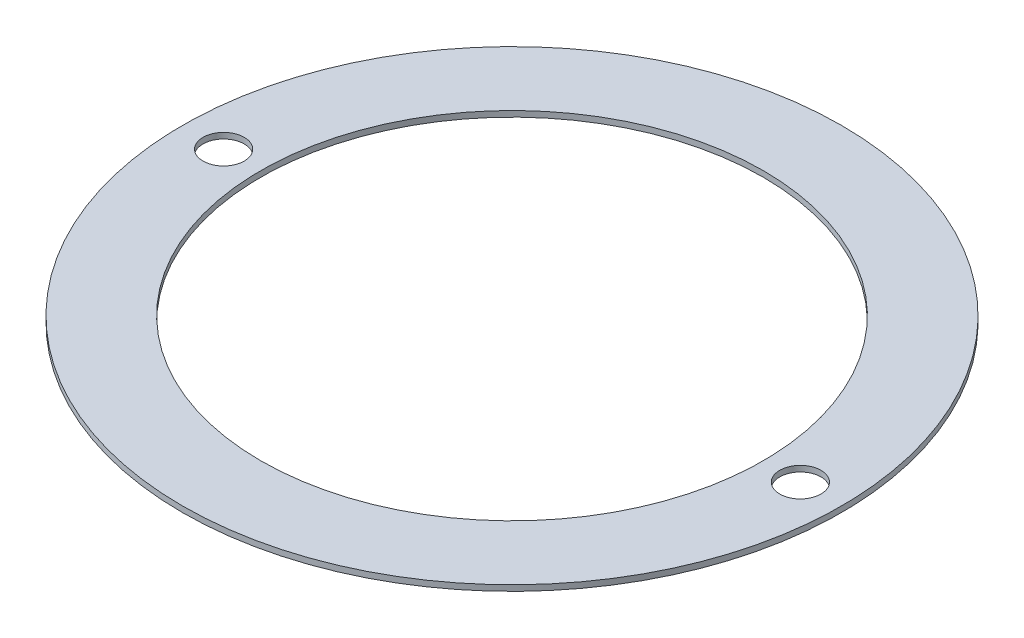
ISO-10303-21;
HEADER;
FILE_DESCRIPTION(('STEP AP214'),'2;1');
FILE_NAME('part.step','',(''),(''),'','','');
FILE_SCHEMA(('AUTOMOTIVE_DESIGN { 1 0 10303 214 1 1 1 1 }'));
ENDSEC;
DATA;
#1=APPLICATION_CONTEXT('core data for automotive mechanical design processes');
#2=APPLICATION_PROTOCOL_DEFINITION('international standard','automotive_design',2000,#1);
#3=PRODUCT_CONTEXT('',#1,'mechanical');
#4=PRODUCT('Part','Part','',(#3));
#5=PRODUCT_RELATED_PRODUCT_CATEGORY('part','',(#4));
#6=PRODUCT_DEFINITION_FORMATION('','',#4);
#7=PRODUCT_DEFINITION_CONTEXT('part definition',#1,'design');
#8=PRODUCT_DEFINITION('design','',#6,#7);
#9=PRODUCT_DEFINITION_SHAPE('','',#8);
#10=(LENGTH_UNIT() NAMED_UNIT(*) SI_UNIT(.MILLI.,.METRE.));
#11=(NAMED_UNIT(*) PLANE_ANGLE_UNIT() SI_UNIT($,.RADIAN.));
#12=(NAMED_UNIT(*) SI_UNIT($,.STERADIAN.) SOLID_ANGLE_UNIT());
#13=UNCERTAINTY_MEASURE_WITH_UNIT(LENGTH_MEASURE(1.E-05),#10,'distance_accuracy_value','');
#14=(GEOMETRIC_REPRESENTATION_CONTEXT(3) GLOBAL_UNCERTAINTY_ASSIGNED_CONTEXT((#13)) GLOBAL_UNIT_ASSIGNED_CONTEXT((#10,
#11,#12)) REPRESENTATION_CONTEXT('',''));
#15=CARTESIAN_POINT('',(0.,0.,0.));
#16=DIRECTION('',(0.,0.,1.));
#17=DIRECTION('',(1.,0.,0.));
#18=AXIS2_PLACEMENT_3D('',#15,#16,#17);
#19=CARTESIAN_POINT('',(0.,0.14,0.));
#20=DIRECTION('',(0.,1.,0.));
#21=DIRECTION('',(0.,0.,1.));
#22=AXIS2_PLACEMENT_3D('',#19,#20,#21);
#23=PLANE('',#22);
#24=CARTESIAN_POINT('',(-7.,0.14,0.));
#25=DIRECTION('',(0.,1.,0.));
#26=DIRECTION('',(0.,0.,1.));
#27=AXIS2_PLACEMENT_3D('',#24,#25,#26);
#28=CIRCLE('',#27,0.5);
#29=CARTESIAN_POINT('',(-7.,0.14,0.5));
#30=VERTEX_POINT('',#29);
#31=EDGE_CURVE('E59',#30,#30,#28,.T.);
#32=ORIENTED_EDGE('',*,*,#31,.F.);
#33=EDGE_LOOP('',(#32));
#34=FACE_BOUND('',#33,.T.);
#35=CARTESIAN_POINT('',(7.,0.14,0.));
#36=DIRECTION('',(0.,1.,0.));
#37=DIRECTION('',(0.,0.,1.));
#38=AXIS2_PLACEMENT_3D('',#35,#36,#37);
#39=CIRCLE('',#38,0.5);
#40=CARTESIAN_POINT('',(7.,0.14,0.5));
#41=VERTEX_POINT('',#40);
#42=EDGE_CURVE('E53',#41,#41,#39,.T.);
#43=ORIENTED_EDGE('',*,*,#42,.F.);
#44=EDGE_LOOP('',(#43));
#45=FACE_BOUND('',#44,.T.);
#46=CARTESIAN_POINT('',(0.,0.14,0.));
#47=DIRECTION('',(0.,1.,0.));
#48=DIRECTION('',(0.,0.,1.));
#49=AXIS2_PLACEMENT_3D('',#46,#47,#48);
#50=CIRCLE('',#49,8.);
#51=CARTESIAN_POINT('',(0.,0.14,8.));
#52=VERTEX_POINT('',#51);
#53=EDGE_CURVE('E10',#52,#52,#50,.T.);
#54=ORIENTED_EDGE('',*,*,#53,.T.);
#55=EDGE_LOOP('',(#54));
#56=FACE_BOUND('',#55,.T.);
#57=CARTESIAN_POINT('',(0.,0.14,0.));
#58=DIRECTION('',(0.,1.,0.));
#59=DIRECTION('',(0.,0.,1.));
#60=AXIS2_PLACEMENT_3D('',#57,#58,#59);
#61=CIRCLE('',#60,6.1);
#62=CARTESIAN_POINT('',(0.,0.14,6.1));
#63=VERTEX_POINT('',#62);
#64=EDGE_CURVE('E43',#63,#63,#61,.T.);
#65=ORIENTED_EDGE('',*,*,#64,.F.);
#66=EDGE_LOOP('',(#65));
#67=FACE_BOUND('',#66,.T.);
#68=ADVANCED_FACE('F32',(#34,#45,#56,#67),#23,.T.);
#69=CARTESIAN_POINT('',(0.,0.,0.));
#70=DIRECTION('',(0.,1.,0.));
#71=DIRECTION('',(0.,0.,1.));
#72=AXIS2_PLACEMENT_3D('',#69,#70,#71);
#73=PLANE('',#72);
#74=CARTESIAN_POINT('',(-7.,0.,0.));
#75=DIRECTION('',(0.,1.,0.));
#76=DIRECTION('',(0.,0.,1.));
#77=AXIS2_PLACEMENT_3D('',#74,#75,#76);
#78=CIRCLE('',#77,0.5);
#79=CARTESIAN_POINT('',(-7.,0.,0.5));
#80=VERTEX_POINT('',#79);
#81=EDGE_CURVE('E56',#80,#80,#78,.T.);
#82=ORIENTED_EDGE('',*,*,#81,.T.);
#83=EDGE_LOOP('',(#82));
#84=FACE_BOUND('',#83,.T.);
#85=CARTESIAN_POINT('',(7.,0.,0.));
#86=DIRECTION('',(0.,1.,0.));
#87=DIRECTION('',(0.,0.,1.));
#88=AXIS2_PLACEMENT_3D('',#85,#86,#87);
#89=CIRCLE('',#88,0.5);
#90=CARTESIAN_POINT('',(7.,0.,0.5));
#91=VERTEX_POINT('',#90);
#92=EDGE_CURVE('E48',#91,#91,#89,.T.);
#93=ORIENTED_EDGE('',*,*,#92,.T.);
#94=EDGE_LOOP('',(#93));
#95=FACE_BOUND('',#94,.T.);
#96=CARTESIAN_POINT('',(0.,0.,0.));
#97=DIRECTION('',(0.,1.,0.));
#98=DIRECTION('',(0.,0.,1.));
#99=AXIS2_PLACEMENT_3D('',#96,#97,#98);
#100=CIRCLE('',#99,8.);
#101=CARTESIAN_POINT('',(0.,0.,8.));
#102=VERTEX_POINT('',#101);
#103=EDGE_CURVE('E36',#102,#102,#100,.T.);
#104=ORIENTED_EDGE('',*,*,#103,.F.);
#105=EDGE_LOOP('',(#104));
#106=FACE_BOUND('',#105,.T.);
#107=CARTESIAN_POINT('',(0.,0.,0.));
#108=DIRECTION('',(0.,1.,0.));
#109=DIRECTION('',(0.,0.,1.));
#110=AXIS2_PLACEMENT_3D('',#107,#108,#109);
#111=CIRCLE('',#110,6.1);
#112=CARTESIAN_POINT('',(0.,0.,6.1));
#113=VERTEX_POINT('',#112);
#114=EDGE_CURVE('E45',#113,#113,#111,.T.);
#115=ORIENTED_EDGE('',*,*,#114,.T.);
#116=EDGE_LOOP('',(#115));
#117=FACE_BOUND('',#116,.T.);
#118=ADVANCED_FACE('F67',(#84,#95,#106,#117),#73,.F.);
#119=CARTESIAN_POINT('',(0.,0.14,0.));
#120=DIRECTION('',(0.,-1.,0.));
#121=DIRECTION('',(0.,0.,-1.));
#122=AXIS2_PLACEMENT_3D('',#119,#120,#121);
#123=CYLINDRICAL_SURFACE('',#122,8.);
#124=ORIENTED_EDGE('',*,*,#53,.F.);
#125=EDGE_LOOP('',(#124));
#126=FACE_BOUND('',#125,.T.);
#127=ORIENTED_EDGE('',*,*,#103,.T.);
#128=EDGE_LOOP('',(#127));
#129=FACE_BOUND('',#128,.T.);
#130=ADVANCED_FACE('F34',(#126,#129),#123,.T.);
#131=CARTESIAN_POINT('',(0.,0.14,0.));
#132=DIRECTION('',(0.,-1.,0.));
#133=DIRECTION('',(0.,0.,-1.));
#134=AXIS2_PLACEMENT_3D('',#131,#132,#133);
#135=CYLINDRICAL_SURFACE('',#134,6.1);
#136=ORIENTED_EDGE('',*,*,#64,.T.);
#137=EDGE_LOOP('',(#136));
#138=FACE_BOUND('',#137,.T.);
#139=ORIENTED_EDGE('',*,*,#114,.F.);
#140=EDGE_LOOP('',(#139));
#141=FACE_BOUND('',#140,.T.);
#142=ADVANCED_FACE('F73',(#138,#141),#135,.F.);
#143=CARTESIAN_POINT('',(7.,0.14,0.));
#144=DIRECTION('',(0.,1.,0.));
#145=DIRECTION('',(0.,0.,1.));
#146=AXIS2_PLACEMENT_3D('',#143,#144,#145);
#147=CYLINDRICAL_SURFACE('',#146,0.5);
#148=ORIENTED_EDGE('',*,*,#92,.F.);
#149=EDGE_LOOP('',(#148));
#150=FACE_BOUND('',#149,.T.);
#151=ORIENTED_EDGE('',*,*,#42,.T.);
#152=EDGE_LOOP('',(#151));
#153=FACE_BOUND('',#152,.T.);
#154=ADVANCED_FACE('F76',(#150,#153),#147,.F.);
#155=CARTESIAN_POINT('',(-7.,0.14,0.));
#156=DIRECTION('',(0.,1.,0.));
#157=DIRECTION('',(0.,0.,1.));
#158=AXIS2_PLACEMENT_3D('',#155,#156,#157);
#159=CYLINDRICAL_SURFACE('',#158,0.5);
#160=ORIENTED_EDGE('',*,*,#81,.F.);
#161=EDGE_LOOP('',(#160));
#162=FACE_BOUND('',#161,.T.);
#163=ORIENTED_EDGE('',*,*,#31,.T.);
#164=EDGE_LOOP('',(#163));
#165=FACE_BOUND('',#164,.T.);
#166=ADVANCED_FACE('F63',(#162,#165),#159,.F.);
#167=CLOSED_SHELL('',(#68,#118,#130,#142,#154,#166));
#168=MANIFOLD_SOLID_BREP('B2',#167);
#169=ADVANCED_BREP_SHAPE_REPRESENTATION('',(#18,#168),#14);
#170=SHAPE_DEFINITION_REPRESENTATION(#9,#169);
ENDSEC;
END-ISO-10303-21;
